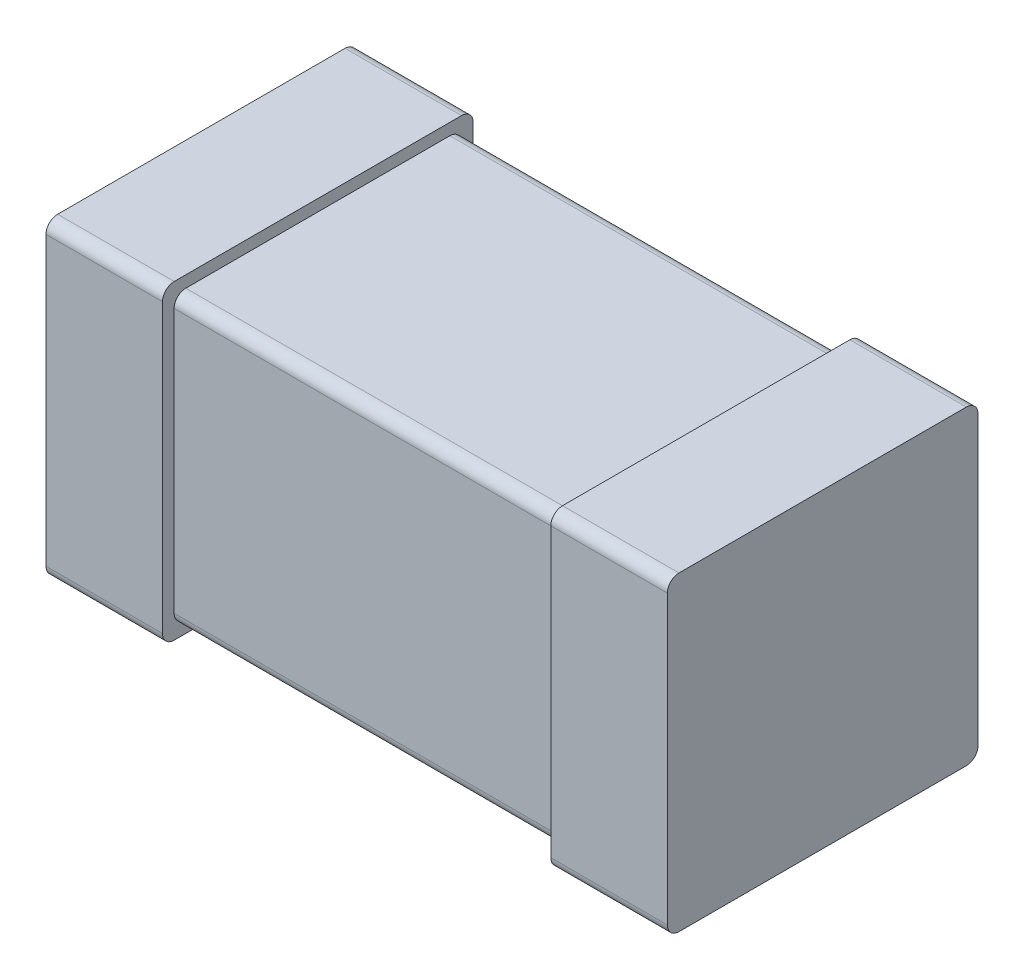
ISO-10303-21;
HEADER;
FILE_DESCRIPTION(('STEP AP214'),'2;1');
FILE_NAME('part.step','',(''),(''),'','','');
FILE_SCHEMA(('AUTOMOTIVE_DESIGN { 1 0 10303 214 1 1 1 1 }'));
ENDSEC;
DATA;
#1=APPLICATION_CONTEXT('core data for automotive mechanical design processes');
#2=APPLICATION_PROTOCOL_DEFINITION('international standard','automotive_design',2000,#1);
#3=PRODUCT_CONTEXT('',#1,'mechanical');
#4=PRODUCT('Part','Part','',(#3));
#5=PRODUCT_RELATED_PRODUCT_CATEGORY('part','',(#4));
#6=PRODUCT_DEFINITION_FORMATION('','',#4);
#7=PRODUCT_DEFINITION_CONTEXT('part definition',#1,'design');
#8=PRODUCT_DEFINITION('design','',#6,#7);
#9=PRODUCT_DEFINITION_SHAPE('','',#8);
#10=(LENGTH_UNIT() NAMED_UNIT(*) SI_UNIT(.MILLI.,.METRE.));
#11=(NAMED_UNIT(*) PLANE_ANGLE_UNIT() SI_UNIT($,.RADIAN.));
#12=(NAMED_UNIT(*) SI_UNIT($,.STERADIAN.) SOLID_ANGLE_UNIT());
#13=UNCERTAINTY_MEASURE_WITH_UNIT(LENGTH_MEASURE(1.E-05),#10,'distance_accuracy_value','');
#14=(GEOMETRIC_REPRESENTATION_CONTEXT(3) GLOBAL_UNCERTAINTY_ASSIGNED_CONTEXT((#13)) GLOBAL_UNIT_ASSIGNED_CONTEXT((#10,
#11,#12)) REPRESENTATION_CONTEXT('',''));
#15=CARTESIAN_POINT('',(0.,0.,0.));
#16=DIRECTION('',(0.,0.,1.));
#17=DIRECTION('',(1.,0.,0.));
#18=AXIS2_PLACEMENT_3D('',#15,#16,#17);
#19=CARTESIAN_POINT('',(0.8,-0.4,0.));
#20=DIRECTION('',(1.,0.,0.));
#21=DIRECTION('',(0.,1.,0.));
#22=AXIS2_PLACEMENT_3D('',#19,#20,#21);
#23=PLANE('',#22);
#24=DIRECTION('',(0.,0.,1.));
#25=VECTOR('',#24,1.);
#26=CARTESIAN_POINT('',(0.8,-0.4,0.));
#27=LINE('',#26,#25);
#28=CARTESIAN_POINT('',(0.8,-0.4,0.03));
#29=VERTEX_POINT('',#28);
#30=CARTESIAN_POINT('',(0.8,-0.4,0.77));
#31=VERTEX_POINT('',#30);
#32=EDGE_CURVE('E242',#29,#31,#27,.T.);
#33=ORIENTED_EDGE('',*,*,#32,.F.);
#34=CARTESIAN_POINT('',(0.8,-0.37,0.03));
#35=DIRECTION('',(1.,0.,0.));
#36=DIRECTION('',(0.,0.,1.));
#37=AXIS2_PLACEMENT_3D('',#34,#35,#36);
#38=CIRCLE('',#37,0.03);
#39=CARTESIAN_POINT('',(0.8,-0.37,0.));
#40=VERTEX_POINT('',#39);
#41=EDGE_CURVE('E248',#29,#40,#38,.T.);
#42=ORIENTED_EDGE('',*,*,#41,.T.);
#43=DIRECTION('',(0.,1.,0.));
#44=VECTOR('',#43,1.);
#45=CARTESIAN_POINT('',(0.8,-0.4,0.));
#46=LINE('',#45,#44);
#47=CARTESIAN_POINT('',(0.8,0.37,0.));
#48=VERTEX_POINT('',#47);
#49=EDGE_CURVE('E249',#40,#48,#46,.T.);
#50=ORIENTED_EDGE('',*,*,#49,.T.);
#51=CARTESIAN_POINT('',(0.8,0.37,0.03));
#52=DIRECTION('',(-1.,0.,0.));
#53=DIRECTION('',(0.,0.,1.));
#54=AXIS2_PLACEMENT_3D('',#51,#52,#53);
#55=CIRCLE('',#54,0.03);
#56=CARTESIAN_POINT('',(0.8,0.4,0.03));
#57=VERTEX_POINT('',#56);
#58=EDGE_CURVE('E111',#57,#48,#55,.T.);
#59=ORIENTED_EDGE('',*,*,#58,.F.);
#60=DIRECTION('',(0.,0.,1.));
#61=VECTOR('',#60,1.);
#62=CARTESIAN_POINT('',(0.8,0.4,0.));
#63=LINE('',#62,#61);
#64=CARTESIAN_POINT('',(0.8,0.4,0.77));
#65=VERTEX_POINT('',#64);
#66=EDGE_CURVE('E11',#57,#65,#63,.T.);
#67=ORIENTED_EDGE('',*,*,#66,.T.);
#68=CARTESIAN_POINT('',(0.8,0.37,0.77));
#69=DIRECTION('',(1.,0.,0.));
#70=DIRECTION('',(0.,0.,1.));
#71=AXIS2_PLACEMENT_3D('',#68,#69,#70);
#72=CIRCLE('',#71,0.03);
#73=CARTESIAN_POINT('',(0.8,0.37,0.8));
#74=VERTEX_POINT('',#73);
#75=EDGE_CURVE('E119',#65,#74,#72,.T.);
#76=ORIENTED_EDGE('',*,*,#75,.T.);
#77=DIRECTION('',(0.,1.,0.));
#78=VECTOR('',#77,1.);
#79=CARTESIAN_POINT('',(0.8,-0.4,0.8));
#80=LINE('',#79,#78);
#81=CARTESIAN_POINT('',(0.8,-0.37,0.8));
#82=VERTEX_POINT('',#81);
#83=EDGE_CURVE('E252',#82,#74,#80,.T.);
#84=ORIENTED_EDGE('',*,*,#83,.F.);
#85=CARTESIAN_POINT('',(0.8,-0.37,0.77));
#86=DIRECTION('',(-1.,0.,0.));
#87=DIRECTION('',(0.,0.,1.));
#88=AXIS2_PLACEMENT_3D('',#85,#86,#87);
#89=CIRCLE('',#88,0.03);
#90=EDGE_CURVE('E189',#31,#82,#89,.T.);
#91=ORIENTED_EDGE('',*,*,#90,.F.);
#92=EDGE_LOOP('',(#33,#42,#50,#59,#67,#76,#84,#91));
#93=FACE_BOUND('',#92,.T.);
#94=ADVANCED_FACE('F17',(#93),#23,.T.);
#95=CARTESIAN_POINT('',(0.5,0.4,0.));
#96=DIRECTION('',(0.,1.,0.));
#97=DIRECTION('',(1.,0.,0.));
#98=AXIS2_PLACEMENT_3D('',#95,#96,#97);
#99=PLANE('',#98);
#100=ORIENTED_EDGE('',*,*,#66,.F.);
#101=DIRECTION('',(1.,0.,0.));
#102=VECTOR('',#101,1.);
#103=CARTESIAN_POINT('',(0.5,0.4,0.03));
#104=LINE('',#103,#102);
#105=CARTESIAN_POINT('',(0.5,0.4,0.03));
#106=VERTEX_POINT('',#105);
#107=EDGE_CURVE('E265',#106,#57,#104,.T.);
#108=ORIENTED_EDGE('',*,*,#107,.F.);
#109=DIRECTION('',(0.,0.,1.));
#110=VECTOR('',#109,1.);
#111=CARTESIAN_POINT('',(0.5,0.4,0.));
#112=LINE('',#111,#110);
#113=CARTESIAN_POINT('',(0.5,0.4,0.77));
#114=VERTEX_POINT('',#113);
#115=EDGE_CURVE('E223',#106,#114,#112,.T.);
#116=ORIENTED_EDGE('',*,*,#115,.T.);
#117=DIRECTION('',(1.,0.,0.));
#118=VECTOR('',#117,1.);
#119=CARTESIAN_POINT('',(0.5,0.4,0.77));
#120=LINE('',#119,#118);
#121=EDGE_CURVE('E20',#114,#65,#120,.T.);
#122=ORIENTED_EDGE('',*,*,#121,.T.);
#123=EDGE_LOOP('',(#100,#108,#116,#122));
#124=FACE_BOUND('',#123,.T.);
#125=ADVANCED_FACE('F273',(#124),#99,.T.);
#126=CARTESIAN_POINT('',(0.5,0.37,0.77));
#127=DIRECTION('',(1.,0.,0.));
#128=DIRECTION('',(0.,1.,0.));
#129=AXIS2_PLACEMENT_3D('',#126,#127,#128);
#130=CYLINDRICAL_SURFACE('',#129,0.03);
#131=CARTESIAN_POINT('',(0.5,0.37,0.77));
#132=DIRECTION('',(1.,0.,0.));
#133=DIRECTION('',(0.,0.,1.));
#134=AXIS2_PLACEMENT_3D('',#131,#132,#133);
#135=CIRCLE('',#134,0.03);
#136=CARTESIAN_POINT('',(0.5,0.37,0.8));
#137=VERTEX_POINT('',#136);
#138=EDGE_CURVE('E203',#114,#137,#135,.T.);
#139=ORIENTED_EDGE('',*,*,#138,.T.);
#140=DIRECTION('',(1.,0.,0.));
#141=VECTOR('',#140,1.);
#142=CARTESIAN_POINT('',(0.5,0.37,0.8));
#143=LINE('',#142,#141);
#144=EDGE_CURVE('E198',#137,#74,#143,.T.);
#145=ORIENTED_EDGE('',*,*,#144,.T.);
#146=ORIENTED_EDGE('',*,*,#75,.F.);
#147=ORIENTED_EDGE('',*,*,#121,.F.);
#148=EDGE_LOOP('',(#139,#145,#146,#147));
#149=FACE_BOUND('',#148,.T.);
#150=ADVANCED_FACE('F276',(#149),#130,.T.);
#151=CARTESIAN_POINT('',(0.5,0.37,0.03));
#152=DIRECTION('',(1.,0.,0.));
#153=DIRECTION('',(0.,1.,0.));
#154=AXIS2_PLACEMENT_3D('',#151,#152,#153);
#155=CYLINDRICAL_SURFACE('',#154,0.03);
#156=ORIENTED_EDGE('',*,*,#107,.T.);
#157=ORIENTED_EDGE('',*,*,#58,.T.);
#158=DIRECTION('',(1.,0.,0.));
#159=VECTOR('',#158,1.);
#160=CARTESIAN_POINT('',(0.5,0.37,0.));
#161=LINE('',#160,#159);
#162=CARTESIAN_POINT('',(0.5,0.37,0.));
#163=VERTEX_POINT('',#162);
#164=EDGE_CURVE('E193',#163,#48,#161,.T.);
#165=ORIENTED_EDGE('',*,*,#164,.F.);
#166=CARTESIAN_POINT('',(0.5,0.37,0.03));
#167=DIRECTION('',(-1.,0.,0.));
#168=DIRECTION('',(0.,0.,1.));
#169=AXIS2_PLACEMENT_3D('',#166,#167,#168);
#170=CIRCLE('',#169,0.03);
#171=EDGE_CURVE('E226',#106,#163,#170,.T.);
#172=ORIENTED_EDGE('',*,*,#171,.F.);
#173=EDGE_LOOP('',(#156,#157,#165,#172));
#174=FACE_BOUND('',#173,.T.);
#175=ADVANCED_FACE('F613',(#174),#155,.T.);
#176=CARTESIAN_POINT('',(0.5,-0.4,0.8));
#177=DIRECTION('',(0.,0.,1.));
#178=DIRECTION('',(1.,0.,0.));
#179=AXIS2_PLACEMENT_3D('',#176,#177,#178);
#180=PLANE('',#179);
#181=DIRECTION('',(0.,1.,0.));
#182=VECTOR('',#181,1.);
#183=CARTESIAN_POINT('',(0.5,-0.4,0.8));
#184=LINE('',#183,#182);
#185=CARTESIAN_POINT('',(0.5,-0.37,0.8));
#186=VERTEX_POINT('',#185);
#187=EDGE_CURVE('E196',#186,#137,#184,.T.);
#188=ORIENTED_EDGE('',*,*,#187,.F.);
#189=DIRECTION('',(1.,0.,0.));
#190=VECTOR('',#189,1.);
#191=CARTESIAN_POINT('',(0.5,-0.37,0.8));
#192=LINE('',#191,#190);
#193=EDGE_CURVE('E183',#186,#82,#192,.T.);
#194=ORIENTED_EDGE('',*,*,#193,.T.);
#195=ORIENTED_EDGE('',*,*,#83,.T.);
#196=ORIENTED_EDGE('',*,*,#144,.F.);
#197=EDGE_LOOP('',(#188,#194,#195,#196));
#198=FACE_BOUND('',#197,.T.);
#199=ADVANCED_FACE('F197',(#198),#180,.T.);
#200=CARTESIAN_POINT('',(0.5,-0.4,0.));
#201=DIRECTION('',(0.,0.,1.));
#202=DIRECTION('',(1.,0.,0.));
#203=AXIS2_PLACEMENT_3D('',#200,#201,#202);
#204=PLANE('',#203);
#205=ORIENTED_EDGE('',*,*,#164,.T.);
#206=ORIENTED_EDGE('',*,*,#49,.F.);
#207=DIRECTION('',(1.,0.,0.));
#208=VECTOR('',#207,1.);
#209=CARTESIAN_POINT('',(0.5,-0.37,0.));
#210=LINE('',#209,#208);
#211=CARTESIAN_POINT('',(0.5,-0.37,0.));
#212=VERTEX_POINT('',#211);
#213=EDGE_CURVE('E244',#212,#40,#210,.T.);
#214=ORIENTED_EDGE('',*,*,#213,.F.);
#215=DIRECTION('',(0.,1.,0.));
#216=VECTOR('',#215,1.);
#217=CARTESIAN_POINT('',(0.5,-0.4,0.));
#218=LINE('',#217,#216);
#219=EDGE_CURVE('E230',#212,#163,#218,.T.);
#220=ORIENTED_EDGE('',*,*,#219,.T.);
#221=EDGE_LOOP('',(#205,#206,#214,#220));
#222=FACE_BOUND('',#221,.T.);
#223=ADVANCED_FACE('F618',(#222),#204,.F.);
#224=CARTESIAN_POINT('',(0.5,-0.37,0.77));
#225=DIRECTION('',(1.,0.,0.));
#226=DIRECTION('',(0.,-1.,0.));
#227=AXIS2_PLACEMENT_3D('',#224,#225,#226);
#228=CYLINDRICAL_SURFACE('',#227,0.03);
#229=DIRECTION('',(1.,0.,0.));
#230=VECTOR('',#229,1.);
#231=CARTESIAN_POINT('',(0.5,-0.4,0.77));
#232=LINE('',#231,#230);
#233=CARTESIAN_POINT('',(0.5,-0.4,0.77));
#234=VERTEX_POINT('',#233);
#235=EDGE_CURVE('E243',#234,#31,#232,.T.);
#236=ORIENTED_EDGE('',*,*,#235,.T.);
#237=ORIENTED_EDGE('',*,*,#90,.T.);
#238=ORIENTED_EDGE('',*,*,#193,.F.);
#239=CARTESIAN_POINT('',(0.5,-0.37,0.77));
#240=DIRECTION('',(-1.,0.,0.));
#241=DIRECTION('',(0.,0.,1.));
#242=AXIS2_PLACEMENT_3D('',#239,#240,#241);
#243=CIRCLE('',#242,0.03);
#244=EDGE_CURVE('E188',#234,#186,#243,.T.);
#245=ORIENTED_EDGE('',*,*,#244,.F.);
#246=EDGE_LOOP('',(#236,#237,#238,#245));
#247=FACE_BOUND('',#246,.T.);
#248=ADVANCED_FACE('F186',(#247),#228,.T.);
#249=CARTESIAN_POINT('',(0.5,-0.37,0.03));
#250=DIRECTION('',(1.,0.,0.));
#251=DIRECTION('',(0.,-1.,0.));
#252=AXIS2_PLACEMENT_3D('',#249,#250,#251);
#253=CYLINDRICAL_SURFACE('',#252,0.03);
#254=CARTESIAN_POINT('',(0.5,-0.37,0.03));
#255=DIRECTION('',(1.,0.,0.));
#256=DIRECTION('',(0.,0.,1.));
#257=AXIS2_PLACEMENT_3D('',#254,#255,#256);
#258=CIRCLE('',#257,0.03);
#259=CARTESIAN_POINT('',(0.5,-0.4,0.03));
#260=VERTEX_POINT('',#259);
#261=EDGE_CURVE('E234',#260,#212,#258,.T.);
#262=ORIENTED_EDGE('',*,*,#261,.T.);
#263=ORIENTED_EDGE('',*,*,#213,.T.);
#264=ORIENTED_EDGE('',*,*,#41,.F.);
#265=DIRECTION('',(1.,0.,0.));
#266=VECTOR('',#265,1.);
#267=CARTESIAN_POINT('',(0.5,-0.4,0.03));
#268=LINE('',#267,#266);
#269=EDGE_CURVE('E238',#260,#29,#268,.T.);
#270=ORIENTED_EDGE('',*,*,#269,.F.);
#271=EDGE_LOOP('',(#262,#263,#264,#270));
#272=FACE_BOUND('',#271,.T.);
#273=ADVANCED_FACE('F624',(#272),#253,.T.);
#274=CARTESIAN_POINT('',(0.5,-0.4,0.));
#275=DIRECTION('',(0.,1.,0.));
#276=DIRECTION('',(1.,0.,0.));
#277=AXIS2_PLACEMENT_3D('',#274,#275,#276);
#278=PLANE('',#277);
#279=ORIENTED_EDGE('',*,*,#235,.F.);
#280=DIRECTION('',(0.,0.,1.));
#281=VECTOR('',#280,1.);
#282=CARTESIAN_POINT('',(0.5,-0.4,0.));
#283=LINE('',#282,#281);
#284=EDGE_CURVE('E209',#260,#234,#283,.T.);
#285=ORIENTED_EDGE('',*,*,#284,.F.);
#286=ORIENTED_EDGE('',*,*,#269,.T.);
#287=ORIENTED_EDGE('',*,*,#32,.T.);
#288=EDGE_LOOP('',(#279,#285,#286,#287));
#289=FACE_BOUND('',#288,.T.);
#290=ADVANCED_FACE('F280',(#289),#278,.F.);
#291=CARTESIAN_POINT('',(0.5,-0.4,0.));
#292=DIRECTION('',(1.,0.,0.));
#293=DIRECTION('',(0.,1.,0.));
#294=AXIS2_PLACEMENT_3D('',#291,#292,#293);
#295=PLANE('',#294);
#296=DIRECTION('',(0.,1.,0.));
#297=VECTOR('',#296,1.);
#298=CARTESIAN_POINT('',(0.5,-0.37,0.03));
#299=LINE('',#298,#297);
#300=CARTESIAN_POINT('',(0.5,-0.34,0.03));
#301=VERTEX_POINT('',#300);
#302=CARTESIAN_POINT('',(0.5,0.34,0.03));
#303=VERTEX_POINT('',#302);
#304=EDGE_CURVE('E342',#301,#303,#299,.T.);
#305=ORIENTED_EDGE('',*,*,#304,.T.);
#306=CARTESIAN_POINT('',(0.5,0.34,0.06));
#307=DIRECTION('',(-1.,0.,0.));
#308=DIRECTION('',(0.,0.,1.));
#309=AXIS2_PLACEMENT_3D('',#306,#307,#308);
#310=CIRCLE('',#309,0.03);
#311=CARTESIAN_POINT('',(0.5,0.37,0.06));
#312=VERTEX_POINT('',#311);
#313=EDGE_CURVE('E350',#312,#303,#310,.T.);
#314=ORIENTED_EDGE('',*,*,#313,.F.);
#315=DIRECTION('',(0.,0.,1.));
#316=VECTOR('',#315,1.);
#317=CARTESIAN_POINT('',(0.5,0.37,0.03));
#318=LINE('',#317,#316);
#319=CARTESIAN_POINT('',(0.5,0.37,0.74));
#320=VERTEX_POINT('',#319);
#321=EDGE_CURVE('E353',#312,#320,#318,.T.);
#322=ORIENTED_EDGE('',*,*,#321,.T.);
#323=CARTESIAN_POINT('',(0.5,0.34,0.74));
#324=DIRECTION('',(1.,0.,0.));
#325=DIRECTION('',(0.,0.,1.));
#326=AXIS2_PLACEMENT_3D('',#323,#324,#325);
#327=CIRCLE('',#326,0.03);
#328=CARTESIAN_POINT('',(0.5,0.34,0.77));
#329=VERTEX_POINT('',#328);
#330=EDGE_CURVE('E366',#320,#329,#327,.T.);
#331=ORIENTED_EDGE('',*,*,#330,.T.);
#332=DIRECTION('',(0.,1.,0.));
#333=VECTOR('',#332,1.);
#334=CARTESIAN_POINT('',(0.5,-0.37,0.77));
#335=LINE('',#334,#333);
#336=CARTESIAN_POINT('',(0.5,-0.34,0.77));
#337=VERTEX_POINT('',#336);
#338=EDGE_CURVE('E370',#337,#329,#335,.T.);
#339=ORIENTED_EDGE('',*,*,#338,.F.);
#340=CARTESIAN_POINT('',(0.5,-0.34,0.74));
#341=DIRECTION('',(-1.,0.,0.));
#342=DIRECTION('',(0.,0.,1.));
#343=AXIS2_PLACEMENT_3D('',#340,#341,#342);
#344=CIRCLE('',#343,0.03);
#345=CARTESIAN_POINT('',(0.5,-0.37,0.74));
#346=VERTEX_POINT('',#345);
#347=EDGE_CURVE('E217',#346,#337,#344,.T.);
#348=ORIENTED_EDGE('',*,*,#347,.F.);
#349=DIRECTION('',(0.,0.,1.));
#350=VECTOR('',#349,1.);
#351=CARTESIAN_POINT('',(0.5,-0.37,0.03));
#352=LINE('',#351,#350);
#353=CARTESIAN_POINT('',(0.5,-0.37,0.06));
#354=VERTEX_POINT('',#353);
#355=EDGE_CURVE('E211',#354,#346,#352,.T.);
#356=ORIENTED_EDGE('',*,*,#355,.F.);
#357=CARTESIAN_POINT('',(0.5,-0.34,0.06));
#358=DIRECTION('',(1.,0.,0.));
#359=DIRECTION('',(0.,0.,1.));
#360=AXIS2_PLACEMENT_3D('',#357,#358,#359);
#361=CIRCLE('',#360,0.03);
#362=EDGE_CURVE('E312',#354,#301,#361,.T.);
#363=ORIENTED_EDGE('',*,*,#362,.T.);
#364=EDGE_LOOP('',(#305,#314,#322,#331,#339,#348,#356,#363));
#365=FACE_BOUND('',#364,.T.);
#366=ORIENTED_EDGE('',*,*,#244,.T.);
#367=ORIENTED_EDGE('',*,*,#187,.T.);
#368=ORIENTED_EDGE('',*,*,#138,.F.);
#369=ORIENTED_EDGE('',*,*,#115,.F.);
#370=ORIENTED_EDGE('',*,*,#171,.T.);
#371=ORIENTED_EDGE('',*,*,#219,.F.);
#372=ORIENTED_EDGE('',*,*,#261,.F.);
#373=ORIENTED_EDGE('',*,*,#284,.T.);
#374=EDGE_LOOP('',(#366,#367,#368,#369,#370,#371,#372,#373));
#375=FACE_BOUND('',#374,.T.);
#376=ADVANCED_FACE('F206',(#365,#375),#295,.F.);
#377=CARTESIAN_POINT('',(-0.5,-0.37,0.03));
#378=DIRECTION('',(0.,1.,0.));
#379=DIRECTION('',(1.,0.,0.));
#380=AXIS2_PLACEMENT_3D('',#377,#378,#379);
#381=PLANE('',#380);
#382=DIRECTION('',(1.,0.,0.));
#383=VECTOR('',#382,1.);
#384=CARTESIAN_POINT('',(-0.5,-0.37,0.74));
#385=LINE('',#384,#383);
#386=CARTESIAN_POINT('',(-0.5,-0.37,0.74));
#387=VERTEX_POINT('',#386);
#388=EDGE_CURVE('E221',#387,#346,#385,.T.);
#389=ORIENTED_EDGE('',*,*,#388,.F.);
#390=DIRECTION('',(0.,0.,1.));
#391=VECTOR('',#390,1.);
#392=CARTESIAN_POINT('',(-0.5,-0.37,0.03));
#393=LINE('',#392,#391);
#394=CARTESIAN_POINT('',(-0.5,-0.37,0.06));
#395=VERTEX_POINT('',#394);
#396=EDGE_CURVE('E307',#395,#387,#393,.T.);
#397=ORIENTED_EDGE('',*,*,#396,.F.);
#398=DIRECTION('',(1.,0.,0.));
#399=VECTOR('',#398,1.);
#400=CARTESIAN_POINT('',(-0.5,-0.37,0.06));
#401=LINE('',#400,#399);
#402=EDGE_CURVE('E331',#395,#354,#401,.T.);
#403=ORIENTED_EDGE('',*,*,#402,.T.);
#404=ORIENTED_EDGE('',*,*,#355,.T.);
#405=EDGE_LOOP('',(#389,#397,#403,#404));
#406=FACE_BOUND('',#405,.T.);
#407=ADVANCED_FACE('F565',(#406),#381,.F.);
#408=CARTESIAN_POINT('',(-0.5,-0.34,0.74));
#409=DIRECTION('',(1.,0.,0.));
#410=DIRECTION('',(0.,-1.,0.));
#411=AXIS2_PLACEMENT_3D('',#408,#409,#410);
#412=CYLINDRICAL_SURFACE('',#411,0.03);
#413=ORIENTED_EDGE('',*,*,#388,.T.);
#414=ORIENTED_EDGE('',*,*,#347,.T.);
#415=DIRECTION('',(1.,0.,0.));
#416=VECTOR('',#415,1.);
#417=CARTESIAN_POINT('',(-0.5,-0.34,0.77));
#418=LINE('',#417,#416);
#419=CARTESIAN_POINT('',(-0.5,-0.34,0.77));
#420=VERTEX_POINT('',#419);
#421=EDGE_CURVE('E369',#420,#337,#418,.T.);
#422=ORIENTED_EDGE('',*,*,#421,.F.);
#423=CARTESIAN_POINT('',(-0.5,-0.34,0.74));
#424=DIRECTION('',(-1.,0.,0.));
#425=DIRECTION('',(0.,0.,1.));
#426=AXIS2_PLACEMENT_3D('',#423,#424,#425);
#427=CIRCLE('',#426,0.03);
#428=EDGE_CURVE('E317',#387,#420,#427,.T.);
#429=ORIENTED_EDGE('',*,*,#428,.F.);
#430=EDGE_LOOP('',(#413,#414,#422,#429));
#431=FACE_BOUND('',#430,.T.);
#432=ADVANCED_FACE('F545',(#431),#412,.T.);
#433=CARTESIAN_POINT('',(-0.5,-0.37,0.77));
#434=DIRECTION('',(0.,0.,1.));
#435=DIRECTION('',(1.,0.,0.));
#436=AXIS2_PLACEMENT_3D('',#433,#434,#435);
#437=PLANE('',#436);
#438=DIRECTION('',(0.,1.,0.));
#439=VECTOR('',#438,1.);
#440=CARTESIAN_POINT('',(-0.5,-0.37,0.77));
#441=LINE('',#440,#439);
#442=CARTESIAN_POINT('',(-0.5,0.34,0.77));
#443=VERTEX_POINT('',#442);
#444=EDGE_CURVE('E323',#420,#443,#441,.T.);
#445=ORIENTED_EDGE('',*,*,#444,.F.);
#446=ORIENTED_EDGE('',*,*,#421,.T.);
#447=ORIENTED_EDGE('',*,*,#338,.T.);
#448=DIRECTION('',(1.,0.,0.));
#449=VECTOR('',#448,1.);
#450=CARTESIAN_POINT('',(-0.5,0.34,0.77));
#451=LINE('',#450,#449);
#452=EDGE_CURVE('E362',#443,#329,#451,.T.);
#453=ORIENTED_EDGE('',*,*,#452,.F.);
#454=EDGE_LOOP('',(#445,#446,#447,#453));
#455=FACE_BOUND('',#454,.T.);
#456=ADVANCED_FACE('F547',(#455),#437,.T.);
#457=CARTESIAN_POINT('',(-0.5,0.34,0.74));
#458=DIRECTION('',(1.,0.,0.));
#459=DIRECTION('',(0.,1.,0.));
#460=AXIS2_PLACEMENT_3D('',#457,#458,#459);
#461=CYLINDRICAL_SURFACE('',#460,0.03);
#462=CARTESIAN_POINT('',(-0.5,0.34,0.74));
#463=DIRECTION('',(1.,0.,0.));
#464=DIRECTION('',(0.,0.,1.));
#465=AXIS2_PLACEMENT_3D('',#462,#463,#464);
#466=CIRCLE('',#465,0.03);
#467=CARTESIAN_POINT('',(-0.5,0.37,0.74));
#468=VERTEX_POINT('',#467);
#469=EDGE_CURVE('E318',#468,#443,#466,.T.);
#470=ORIENTED_EDGE('',*,*,#469,.T.);
#471=ORIENTED_EDGE('',*,*,#452,.T.);
#472=ORIENTED_EDGE('',*,*,#330,.F.);
#473=DIRECTION('',(1.,0.,0.));
#474=VECTOR('',#473,1.);
#475=CARTESIAN_POINT('',(-0.5,0.37,0.74));
#476=LINE('',#475,#474);
#477=EDGE_CURVE('E358',#468,#320,#476,.T.);
#478=ORIENTED_EDGE('',*,*,#477,.F.);
#479=EDGE_LOOP('',(#470,#471,#472,#478));
#480=FACE_BOUND('',#479,.T.);
#481=ADVANCED_FACE('F549',(#480),#461,.T.);
#482=CARTESIAN_POINT('',(-0.5,0.37,0.03));
#483=DIRECTION('',(0.,1.,0.));
#484=DIRECTION('',(1.,0.,0.));
#485=AXIS2_PLACEMENT_3D('',#482,#483,#484);
#486=PLANE('',#485);
#487=ORIENTED_EDGE('',*,*,#321,.F.);
#488=DIRECTION('',(1.,0.,0.));
#489=VECTOR('',#488,1.);
#490=CARTESIAN_POINT('',(-0.5,0.37,0.06));
#491=LINE('',#490,#489);
#492=CARTESIAN_POINT('',(-0.5,0.37,0.06));
#493=VERTEX_POINT('',#492);
#494=EDGE_CURVE('E346',#493,#312,#491,.T.);
#495=ORIENTED_EDGE('',*,*,#494,.F.);
#496=DIRECTION('',(0.,0.,1.));
#497=VECTOR('',#496,1.);
#498=CARTESIAN_POINT('',(-0.5,0.37,0.03));
#499=LINE('',#498,#497);
#500=EDGE_CURVE('E322',#493,#468,#499,.T.);
#501=ORIENTED_EDGE('',*,*,#500,.T.);
#502=ORIENTED_EDGE('',*,*,#477,.T.);
#503=EDGE_LOOP('',(#487,#495,#501,#502));
#504=FACE_BOUND('',#503,.T.);
#505=ADVANCED_FACE('F554',(#504),#486,.T.);
#506=CARTESIAN_POINT('',(-0.5,0.34,0.06));
#507=DIRECTION('',(1.,0.,0.));
#508=DIRECTION('',(0.,1.,0.));
#509=AXIS2_PLACEMENT_3D('',#506,#507,#508);
#510=CYLINDRICAL_SURFACE('',#509,0.03);
#511=ORIENTED_EDGE('',*,*,#494,.T.);
#512=ORIENTED_EDGE('',*,*,#313,.T.);
#513=DIRECTION('',(1.,0.,0.));
#514=VECTOR('',#513,1.);
#515=CARTESIAN_POINT('',(-0.5,0.34,0.03));
#516=LINE('',#515,#514);
#517=CARTESIAN_POINT('',(-0.5,0.34,0.03));
#518=VERTEX_POINT('',#517);
#519=EDGE_CURVE('E335',#518,#303,#516,.T.);
#520=ORIENTED_EDGE('',*,*,#519,.F.);
#521=CARTESIAN_POINT('',(-0.5,0.34,0.06));
#522=DIRECTION('',(-1.,0.,0.));
#523=DIRECTION('',(0.,0.,1.));
#524=AXIS2_PLACEMENT_3D('',#521,#522,#523);
#525=CIRCLE('',#524,0.03);
#526=EDGE_CURVE('E326',#493,#518,#525,.T.);
#527=ORIENTED_EDGE('',*,*,#526,.F.);
#528=EDGE_LOOP('',(#511,#512,#520,#527));
#529=FACE_BOUND('',#528,.T.);
#530=ADVANCED_FACE('F557',(#529),#510,.T.);
#531=CARTESIAN_POINT('',(-0.5,-0.37,0.03));
#532=DIRECTION('',(0.,0.,1.));
#533=DIRECTION('',(1.,0.,0.));
#534=AXIS2_PLACEMENT_3D('',#531,#532,#533);
#535=PLANE('',#534);
#536=ORIENTED_EDGE('',*,*,#519,.T.);
#537=ORIENTED_EDGE('',*,*,#304,.F.);
#538=DIRECTION('',(1.,0.,0.));
#539=VECTOR('',#538,1.);
#540=CARTESIAN_POINT('',(-0.5,-0.34,0.03));
#541=LINE('',#540,#539);
#542=CARTESIAN_POINT('',(-0.5,-0.34,0.03));
#543=VERTEX_POINT('',#542);
#544=EDGE_CURVE('E308',#543,#301,#541,.T.);
#545=ORIENTED_EDGE('',*,*,#544,.F.);
#546=DIRECTION('',(0.,1.,0.));
#547=VECTOR('',#546,1.);
#548=CARTESIAN_POINT('',(-0.5,-0.37,0.03));
#549=LINE('',#548,#547);
#550=EDGE_CURVE('E313',#543,#518,#549,.T.);
#551=ORIENTED_EDGE('',*,*,#550,.T.);
#552=EDGE_LOOP('',(#536,#537,#545,#551));
#553=FACE_BOUND('',#552,.T.);
#554=ADVANCED_FACE('F560',(#553),#535,.F.);
#555=CARTESIAN_POINT('',(-0.5,-0.34,0.06));
#556=DIRECTION('',(1.,0.,0.));
#557=DIRECTION('',(0.,-1.,0.));
#558=AXIS2_PLACEMENT_3D('',#555,#556,#557);
#559=CYLINDRICAL_SURFACE('',#558,0.03);
#560=CARTESIAN_POINT('',(-0.5,-0.34,0.06));
#561=DIRECTION('',(1.,0.,0.));
#562=DIRECTION('',(0.,0.,1.));
#563=AXIS2_PLACEMENT_3D('',#560,#561,#562);
#564=CIRCLE('',#563,0.03);
#565=EDGE_CURVE('E303',#395,#543,#564,.T.);
#566=ORIENTED_EDGE('',*,*,#565,.T.);
#567=ORIENTED_EDGE('',*,*,#544,.T.);
#568=ORIENTED_EDGE('',*,*,#362,.F.);
#569=ORIENTED_EDGE('',*,*,#402,.F.);
#570=EDGE_LOOP('',(#566,#567,#568,#569));
#571=FACE_BOUND('',#570,.T.);
#572=ADVANCED_FACE('F562',(#571),#559,.T.);
#573=CARTESIAN_POINT('',(-0.5,-0.4,0.));
#574=DIRECTION('',(1.,0.,0.));
#575=DIRECTION('',(0.,1.,0.));
#576=AXIS2_PLACEMENT_3D('',#573,#574,#575);
#577=PLANE('',#576);
#578=ORIENTED_EDGE('',*,*,#565,.F.);
#579=ORIENTED_EDGE('',*,*,#396,.T.);
#580=ORIENTED_EDGE('',*,*,#428,.T.);
#581=ORIENTED_EDGE('',*,*,#444,.T.);
#582=ORIENTED_EDGE('',*,*,#469,.F.);
#583=ORIENTED_EDGE('',*,*,#500,.F.);
#584=ORIENTED_EDGE('',*,*,#526,.T.);
#585=ORIENTED_EDGE('',*,*,#550,.F.);
#586=EDGE_LOOP('',(#578,#579,#580,#581,#582,#583,#584,#585));
#587=FACE_BOUND('',#586,.T.);
#588=DIRECTION('',(0.,0.,1.));
#589=VECTOR('',#588,1.);
#590=CARTESIAN_POINT('',(-0.5,-0.4,0.));
#591=LINE('',#590,#589);
#592=CARTESIAN_POINT('',(-0.5,-0.4,0.03));
#593=VERTEX_POINT('',#592);
#594=CARTESIAN_POINT('',(-0.5,-0.4,0.77));
#595=VERTEX_POINT('',#594);
#596=EDGE_CURVE('E407',#593,#595,#591,.T.);
#597=ORIENTED_EDGE('',*,*,#596,.F.);
#598=CARTESIAN_POINT('',(-0.5,-0.37,0.03));
#599=DIRECTION('',(1.,0.,0.));
#600=DIRECTION('',(0.,0.,1.));
#601=AXIS2_PLACEMENT_3D('',#598,#599,#600);
#602=CIRCLE('',#601,0.03);
#603=CARTESIAN_POINT('',(-0.5,-0.37,0.));
#604=VERTEX_POINT('',#603);
#605=EDGE_CURVE('E422',#593,#604,#602,.T.);
#606=ORIENTED_EDGE('',*,*,#605,.T.);
#607=DIRECTION('',(0.,1.,0.));
#608=VECTOR('',#607,1.);
#609=CARTESIAN_POINT('',(-0.5,-0.4,0.));
#610=LINE('',#609,#608);
#611=CARTESIAN_POINT('',(-0.5,0.37,0.));
#612=VERTEX_POINT('',#611);
#613=EDGE_CURVE('E434',#604,#612,#610,.T.);
#614=ORIENTED_EDGE('',*,*,#613,.T.);
#615=CARTESIAN_POINT('',(-0.5,0.37,0.03));
#616=DIRECTION('',(-1.,0.,0.));
#617=DIRECTION('',(0.,0.,1.));
#618=AXIS2_PLACEMENT_3D('',#615,#616,#617);
#619=CIRCLE('',#618,0.03);
#620=CARTESIAN_POINT('',(-0.5,0.4,0.03));
#621=VERTEX_POINT('',#620);
#622=EDGE_CURVE('E293',#621,#612,#619,.T.);
#623=ORIENTED_EDGE('',*,*,#622,.F.);
#624=DIRECTION('',(0.,0.,1.));
#625=VECTOR('',#624,1.);
#626=CARTESIAN_POINT('',(-0.5,0.4,0.));
#627=LINE('',#626,#625);
#628=CARTESIAN_POINT('',(-0.5,0.4,0.77));
#629=VERTEX_POINT('',#628);
#630=EDGE_CURVE('E302',#621,#629,#627,.T.);
#631=ORIENTED_EDGE('',*,*,#630,.T.);
#632=CARTESIAN_POINT('',(-0.5,0.37,0.77));
#633=DIRECTION('',(1.,0.,0.));
#634=DIRECTION('',(0.,0.,1.));
#635=AXIS2_PLACEMENT_3D('',#632,#633,#634);
#636=CIRCLE('',#635,0.03);
#637=CARTESIAN_POINT('',(-0.5,0.37,0.8));
#638=VERTEX_POINT('',#637);
#639=EDGE_CURVE('E297',#629,#638,#636,.T.);
#640=ORIENTED_EDGE('',*,*,#639,.T.);
#641=DIRECTION('',(0.,1.,0.));
#642=VECTOR('',#641,1.);
#643=CARTESIAN_POINT('',(-0.5,-0.4,0.8));
#644=LINE('',#643,#642);
#645=CARTESIAN_POINT('',(-0.5,-0.37,0.8));
#646=VERTEX_POINT('',#645);
#647=EDGE_CURVE('E438',#646,#638,#644,.T.);
#648=ORIENTED_EDGE('',*,*,#647,.F.);
#649=CARTESIAN_POINT('',(-0.5,-0.37,0.77));
#650=DIRECTION('',(-1.,0.,0.));
#651=DIRECTION('',(0.,0.,1.));
#652=AXIS2_PLACEMENT_3D('',#649,#650,#651);
#653=CIRCLE('',#652,0.03);
#654=EDGE_CURVE('E417',#595,#646,#653,.T.);
#655=ORIENTED_EDGE('',*,*,#654,.F.);
#656=EDGE_LOOP('',(#597,#606,#614,#623,#631,#640,#648,#655));
#657=FACE_BOUND('',#656,.T.);
#658=ADVANCED_FACE('F540',(#587,#657),#577,.T.);
#659=CARTESIAN_POINT('',(-0.8,0.4,0.));
#660=DIRECTION('',(0.,1.,0.));
#661=DIRECTION('',(1.,0.,0.));
#662=AXIS2_PLACEMENT_3D('',#659,#660,#661);
#663=PLANE('',#662);
#664=ORIENTED_EDGE('',*,*,#630,.F.);
#665=DIRECTION('',(1.,0.,0.));
#666=VECTOR('',#665,1.);
#667=CARTESIAN_POINT('',(-0.8,0.4,0.03));
#668=LINE('',#667,#666);
#669=CARTESIAN_POINT('',(-0.8,0.4,0.03));
#670=VERTEX_POINT('',#669);
#671=EDGE_CURVE('E290',#670,#621,#668,.T.);
#672=ORIENTED_EDGE('',*,*,#671,.F.);
#673=DIRECTION('',(0.,0.,1.));
#674=VECTOR('',#673,1.);
#675=CARTESIAN_POINT('',(-0.8,0.4,0.));
#676=LINE('',#675,#674);
#677=CARTESIAN_POINT('',(-0.8,0.4,0.77));
#678=VERTEX_POINT('',#677);
#679=EDGE_CURVE('E385',#670,#678,#676,.T.);
#680=ORIENTED_EDGE('',*,*,#679,.T.);
#681=DIRECTION('',(1.,0.,0.));
#682=VECTOR('',#681,1.);
#683=CARTESIAN_POINT('',(-0.8,0.4,0.77));
#684=LINE('',#683,#682);
#685=EDGE_CURVE('E298',#678,#629,#684,.T.);
#686=ORIENTED_EDGE('',*,*,#685,.T.);
#687=EDGE_LOOP('',(#664,#672,#680,#686));
#688=FACE_BOUND('',#687,.T.);
#689=ADVANCED_FACE('F464',(#688),#663,.T.);
#690=CARTESIAN_POINT('',(-0.8,0.37,0.77));
#691=DIRECTION('',(1.,0.,0.));
#692=DIRECTION('',(0.,1.,0.));
#693=AXIS2_PLACEMENT_3D('',#690,#691,#692);
#694=CYLINDRICAL_SURFACE('',#693,0.03);
#695=CARTESIAN_POINT('',(-0.8,0.37,0.77));
#696=DIRECTION('',(1.,0.,0.));
#697=DIRECTION('',(0.,0.,1.));
#698=AXIS2_PLACEMENT_3D('',#695,#696,#697);
#699=CIRCLE('',#698,0.03);
#700=CARTESIAN_POINT('',(-0.8,0.37,0.8));
#701=VERTEX_POINT('',#700);
#702=EDGE_CURVE('E524',#678,#701,#699,.T.);
#703=ORIENTED_EDGE('',*,*,#702,.T.);
#704=DIRECTION('',(1.,0.,0.));
#705=VECTOR('',#704,1.);
#706=CARTESIAN_POINT('',(-0.8,0.37,0.8));
#707=LINE('',#706,#705);
#708=EDGE_CURVE('E441',#701,#638,#707,.T.);
#709=ORIENTED_EDGE('',*,*,#708,.T.);
#710=ORIENTED_EDGE('',*,*,#639,.F.);
#711=ORIENTED_EDGE('',*,*,#685,.F.);
#712=EDGE_LOOP('',(#703,#709,#710,#711));
#713=FACE_BOUND('',#712,.T.);
#714=ADVANCED_FACE('F594',(#713),#694,.T.);
#715=CARTESIAN_POINT('',(-0.8,0.37,0.03));
#716=DIRECTION('',(1.,0.,0.));
#717=DIRECTION('',(0.,1.,0.));
#718=AXIS2_PLACEMENT_3D('',#715,#716,#717);
#719=CYLINDRICAL_SURFACE('',#718,0.03);
#720=ORIENTED_EDGE('',*,*,#671,.T.);
#721=ORIENTED_EDGE('',*,*,#622,.T.);
#722=DIRECTION('',(1.,0.,0.));
#723=VECTOR('',#722,1.);
#724=CARTESIAN_POINT('',(-0.8,0.37,0.));
#725=LINE('',#724,#723);
#726=CARTESIAN_POINT('',(-0.8,0.37,0.));
#727=VERTEX_POINT('',#726);
#728=EDGE_CURVE('E428',#727,#612,#725,.T.);
#729=ORIENTED_EDGE('',*,*,#728,.F.);
#730=CARTESIAN_POINT('',(-0.8,0.37,0.03));
#731=DIRECTION('',(-1.,0.,0.));
#732=DIRECTION('',(0.,0.,1.));
#733=AXIS2_PLACEMENT_3D('',#730,#731,#732);
#734=CIRCLE('',#733,0.03);
#735=EDGE_CURVE('E387',#670,#727,#734,.T.);
#736=ORIENTED_EDGE('',*,*,#735,.F.);
#737=EDGE_LOOP('',(#720,#721,#729,#736));
#738=FACE_BOUND('',#737,.T.);
#739=ADVANCED_FACE('F454',(#738),#719,.T.);
#740=CARTESIAN_POINT('',(-0.8,-0.4,0.8));
#741=DIRECTION('',(0.,0.,1.));
#742=DIRECTION('',(1.,0.,0.));
#743=AXIS2_PLACEMENT_3D('',#740,#741,#742);
#744=PLANE('',#743);
#745=DIRECTION('',(0.,1.,0.));
#746=VECTOR('',#745,1.);
#747=CARTESIAN_POINT('',(-0.8,-0.4,0.8));
#748=LINE('',#747,#746);
#749=CARTESIAN_POINT('',(-0.8,-0.37,0.8));
#750=VERTEX_POINT('',#749);
#751=EDGE_CURVE('E521',#750,#701,#748,.T.);
#752=ORIENTED_EDGE('',*,*,#751,.F.);
#753=DIRECTION('',(1.,0.,0.));
#754=VECTOR('',#753,1.);
#755=CARTESIAN_POINT('',(-0.8,-0.37,0.8));
#756=LINE('',#755,#754);
#757=EDGE_CURVE('E421',#750,#646,#756,.T.);
#758=ORIENTED_EDGE('',*,*,#757,.T.);
#759=ORIENTED_EDGE('',*,*,#647,.T.);
#760=ORIENTED_EDGE('',*,*,#708,.F.);
#761=EDGE_LOOP('',(#752,#758,#759,#760));
#762=FACE_BOUND('',#761,.T.);
#763=ADVANCED_FACE('F588',(#762),#744,.T.);
#764=CARTESIAN_POINT('',(-0.8,-0.4,0.));
#765=DIRECTION('',(0.,0.,1.));
#766=DIRECTION('',(1.,0.,0.));
#767=AXIS2_PLACEMENT_3D('',#764,#765,#766);
#768=PLANE('',#767);
#769=ORIENTED_EDGE('',*,*,#728,.T.);
#770=ORIENTED_EDGE('',*,*,#613,.F.);
#771=DIRECTION('',(1.,0.,0.));
#772=VECTOR('',#771,1.);
#773=CARTESIAN_POINT('',(-0.8,-0.37,0.));
#774=LINE('',#773,#772);
#775=CARTESIAN_POINT('',(-0.8,-0.37,0.));
#776=VERTEX_POINT('',#775);
#777=EDGE_CURVE('E411',#776,#604,#774,.T.);
#778=ORIENTED_EDGE('',*,*,#777,.F.);
#779=DIRECTION('',(0.,1.,0.));
#780=VECTOR('',#779,1.);
#781=CARTESIAN_POINT('',(-0.8,-0.4,0.));
#782=LINE('',#781,#780);
#783=EDGE_CURVE('E390',#776,#727,#782,.T.);
#784=ORIENTED_EDGE('',*,*,#783,.T.);
#785=EDGE_LOOP('',(#769,#770,#778,#784));
#786=FACE_BOUND('',#785,.T.);
#787=ADVANCED_FACE('F809',(#786),#768,.F.);
#788=CARTESIAN_POINT('',(-0.8,-0.37,0.77));
#789=DIRECTION('',(1.,0.,0.));
#790=DIRECTION('',(0.,-1.,0.));
#791=AXIS2_PLACEMENT_3D('',#788,#789,#790);
#792=CYLINDRICAL_SURFACE('',#791,0.03);
#793=DIRECTION('',(1.,0.,0.));
#794=VECTOR('',#793,1.);
#795=CARTESIAN_POINT('',(-0.8,-0.4,0.77));
#796=LINE('',#795,#794);
#797=CARTESIAN_POINT('',(-0.8,-0.4,0.77));
#798=VERTEX_POINT('',#797);
#799=EDGE_CURVE('E399',#798,#595,#796,.T.);
#800=ORIENTED_EDGE('',*,*,#799,.T.);
#801=ORIENTED_EDGE('',*,*,#654,.T.);
#802=ORIENTED_EDGE('',*,*,#757,.F.);
#803=CARTESIAN_POINT('',(-0.8,-0.37,0.77));
#804=DIRECTION('',(-1.,0.,0.));
#805=DIRECTION('',(0.,0.,1.));
#806=AXIS2_PLACEMENT_3D('',#803,#804,#805);
#807=CIRCLE('',#806,0.03);
#808=EDGE_CURVE('E516',#798,#750,#807,.T.);
#809=ORIENTED_EDGE('',*,*,#808,.F.);
#810=EDGE_LOOP('',(#800,#801,#802,#809));
#811=FACE_BOUND('',#810,.T.);
#812=ADVANCED_FACE('F590',(#811),#792,.T.);
#813=CARTESIAN_POINT('',(-0.8,-0.37,0.03));
#814=DIRECTION('',(1.,0.,0.));
#815=DIRECTION('',(0.,-1.,0.));
#816=AXIS2_PLACEMENT_3D('',#813,#814,#815);
#817=CYLINDRICAL_SURFACE('',#816,0.03);
#818=CARTESIAN_POINT('',(-0.8,-0.37,0.03));
#819=DIRECTION('',(1.,0.,0.));
#820=DIRECTION('',(0.,0.,1.));
#821=AXIS2_PLACEMENT_3D('',#818,#819,#820);
#822=CIRCLE('',#821,0.03);
#823=CARTESIAN_POINT('',(-0.8,-0.4,0.03));
#824=VERTEX_POINT('',#823);
#825=EDGE_CURVE('E394',#824,#776,#822,.T.);
#826=ORIENTED_EDGE('',*,*,#825,.T.);
#827=ORIENTED_EDGE('',*,*,#777,.T.);
#828=ORIENTED_EDGE('',*,*,#605,.F.);
#829=DIRECTION('',(1.,0.,0.));
#830=VECTOR('',#829,1.);
#831=CARTESIAN_POINT('',(-0.8,-0.4,0.03));
#832=LINE('',#831,#830);
#833=EDGE_CURVE('E403',#824,#593,#832,.T.);
#834=ORIENTED_EDGE('',*,*,#833,.F.);
#835=EDGE_LOOP('',(#826,#827,#828,#834));
#836=FACE_BOUND('',#835,.T.);
#837=ADVANCED_FACE('F496',(#836),#817,.T.);
#838=CARTESIAN_POINT('',(-0.8,-0.4,0.));
#839=DIRECTION('',(0.,1.,0.));
#840=DIRECTION('',(1.,0.,0.));
#841=AXIS2_PLACEMENT_3D('',#838,#839,#840);
#842=PLANE('',#841);
#843=ORIENTED_EDGE('',*,*,#799,.F.);
#844=DIRECTION('',(0.,0.,1.));
#845=VECTOR('',#844,1.);
#846=CARTESIAN_POINT('',(-0.8,-0.4,0.));
#847=LINE('',#846,#845);
#848=EDGE_CURVE('E395',#824,#798,#847,.T.);
#849=ORIENTED_EDGE('',*,*,#848,.F.);
#850=ORIENTED_EDGE('',*,*,#833,.T.);
#851=ORIENTED_EDGE('',*,*,#596,.T.);
#852=EDGE_LOOP('',(#843,#849,#850,#851));
#853=FACE_BOUND('',#852,.T.);
#854=ADVANCED_FACE('F503',(#853),#842,.F.);
#855=CARTESIAN_POINT('',(-0.8,-0.4,0.));
#856=DIRECTION('',(1.,0.,0.));
#857=DIRECTION('',(0.,1.,0.));
#858=AXIS2_PLACEMENT_3D('',#855,#856,#857);
#859=PLANE('',#858);
#860=ORIENTED_EDGE('',*,*,#808,.T.);
#861=ORIENTED_EDGE('',*,*,#751,.T.);
#862=ORIENTED_EDGE('',*,*,#702,.F.);
#863=ORIENTED_EDGE('',*,*,#679,.F.);
#864=ORIENTED_EDGE('',*,*,#735,.T.);
#865=ORIENTED_EDGE('',*,*,#783,.F.);
#866=ORIENTED_EDGE('',*,*,#825,.F.);
#867=ORIENTED_EDGE('',*,*,#848,.T.);
#868=EDGE_LOOP('',(#860,#861,#862,#863,#864,#865,#866,#867));
#869=FACE_BOUND('',#868,.T.);
#870=ADVANCED_FACE('F508',(#869),#859,.F.);
#871=CLOSED_SHELL('',(#94,#125,#150,#175,#199,#223,#248,#273,#290,#376,#407,#432,#456,#481,#505,
#530,#554,#572,#658,#689,#714,#739,#763,#787,#812,#837,#854,#870));
#872=MANIFOLD_SOLID_BREP('B1',#871);
#873=ADVANCED_BREP_SHAPE_REPRESENTATION('',(#18,#872),#14);
#874=SHAPE_DEFINITION_REPRESENTATION(#9,#873);
ENDSEC;
END-ISO-10303-21;
